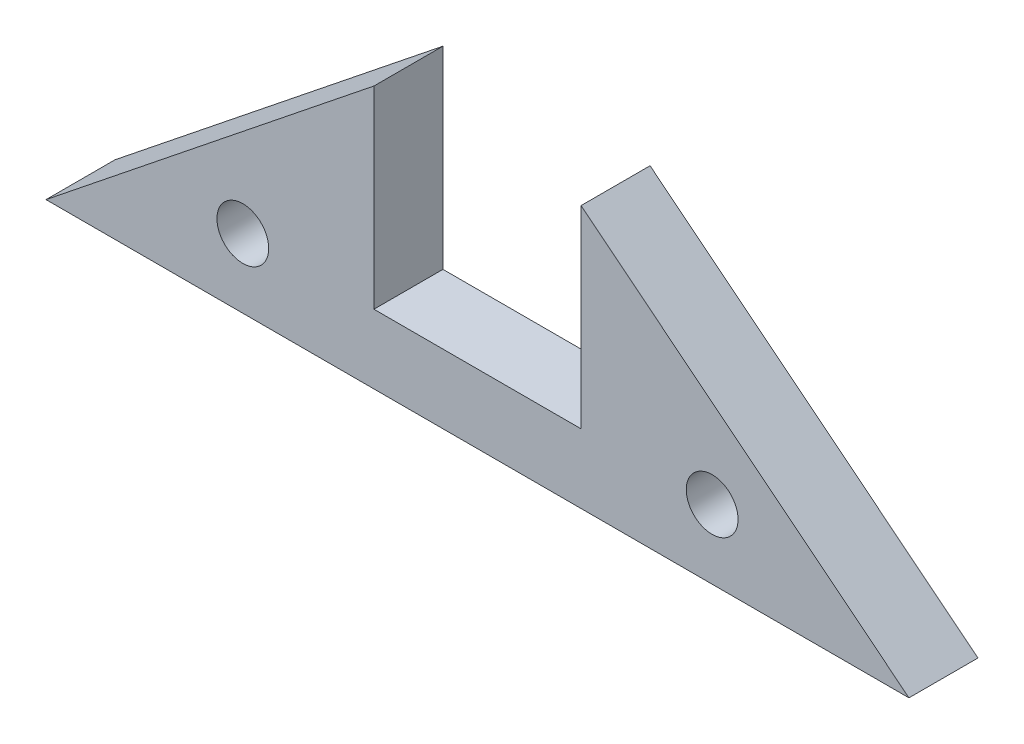
ISO-10303-21;
HEADER;
FILE_DESCRIPTION(('STEP AP214'),'2;1');
FILE_NAME('part.step','',(''),(''),'','','');
FILE_SCHEMA(('AUTOMOTIVE_DESIGN { 1 0 10303 214 1 1 1 1 }'));
ENDSEC;
DATA;
#1=APPLICATION_CONTEXT('core data for automotive mechanical design processes');
#2=APPLICATION_PROTOCOL_DEFINITION('international standard','automotive_design',2000,#1);
#3=PRODUCT_CONTEXT('',#1,'mechanical');
#4=PRODUCT('Part','Part','',(#3));
#5=PRODUCT_RELATED_PRODUCT_CATEGORY('part','',(#4));
#6=PRODUCT_DEFINITION_FORMATION('','',#4);
#7=PRODUCT_DEFINITION_CONTEXT('part definition',#1,'design');
#8=PRODUCT_DEFINITION('design','',#6,#7);
#9=PRODUCT_DEFINITION_SHAPE('','',#8);
#10=(LENGTH_UNIT() NAMED_UNIT(*) SI_UNIT(.MILLI.,.METRE.));
#11=(NAMED_UNIT(*) PLANE_ANGLE_UNIT() SI_UNIT($,.RADIAN.));
#12=(NAMED_UNIT(*) SI_UNIT($,.STERADIAN.) SOLID_ANGLE_UNIT());
#13=UNCERTAINTY_MEASURE_WITH_UNIT(LENGTH_MEASURE(1.E-05),#10,'distance_accuracy_value','');
#14=(GEOMETRIC_REPRESENTATION_CONTEXT(3) GLOBAL_UNCERTAINTY_ASSIGNED_CONTEXT((#13)) GLOBAL_UNIT_ASSIGNED_CONTEXT((#10,
#11,#12)) REPRESENTATION_CONTEXT('',''));
#15=CARTESIAN_POINT('',(0.,0.,0.));
#16=DIRECTION('',(0.,0.,1.));
#17=DIRECTION('',(1.,0.,0.));
#18=AXIS2_PLACEMENT_3D('',#15,#16,#17);
#19=CARTESIAN_POINT('',(31.75,25.4,5.08));
#20=DIRECTION('',(0.624695047554424,-0.78086880944303,0.));
#21=DIRECTION('',(0.78086880944303,0.624695047554424,0.));
#22=AXIS2_PLACEMENT_3D('',#19,#20,#21);
#23=PLANE('',#22);
#24=DIRECTION('',(-0.78086880944303,-0.624695047554424,0.));
#25=VECTOR('',#24,1.);
#26=CARTESIAN_POINT('',(31.75,25.4,5.08));
#27=LINE('',#26,#25);
#28=CARTESIAN_POINT('',(24.13,19.304,5.08));
#29=VERTEX_POINT('',#28);
#30=CARTESIAN_POINT('',(0.,0.,5.08));
#31=VERTEX_POINT('',#30);
#32=EDGE_CURVE('E99',#29,#31,#27,.T.);
#33=ORIENTED_EDGE('',*,*,#32,.F.);
#34=DIRECTION('',(0.,0.,-1.));
#35=VECTOR('',#34,1.);
#36=CARTESIAN_POINT('',(24.13,19.304,5.08));
#37=LINE('',#36,#35);
#38=CARTESIAN_POINT('',(24.13,19.304,0.));
#39=VERTEX_POINT('',#38);
#40=EDGE_CURVE('E129',#29,#39,#37,.T.);
#41=ORIENTED_EDGE('',*,*,#40,.T.);
#42=DIRECTION('',(-0.78086880944303,-0.624695047554424,0.));
#43=VECTOR('',#42,1.);
#44=CARTESIAN_POINT('',(31.75,25.4,0.));
#45=LINE('',#44,#43);
#46=CARTESIAN_POINT('',(0.,0.,0.));
#47=VERTEX_POINT('',#46);
#48=EDGE_CURVE('E85',#39,#47,#45,.T.);
#49=ORIENTED_EDGE('',*,*,#48,.T.);
#50=DIRECTION('',(0.,0.,-1.));
#51=VECTOR('',#50,1.);
#52=CARTESIAN_POINT('',(0.,0.,5.08));
#53=LINE('',#52,#51);
#54=EDGE_CURVE('E80',#31,#47,#53,.T.);
#55=ORIENTED_EDGE('',*,*,#54,.F.);
#56=EDGE_LOOP('',(#33,#41,#49,#55));
#57=FACE_BOUND('',#56,.T.);
#58=ADVANCED_FACE('F38',(#57),#23,.F.);
#59=CARTESIAN_POINT('',(0.,0.,5.08));
#60=DIRECTION('',(0.,1.,0.));
#61=DIRECTION('',(0.,0.,1.));
#62=AXIS2_PLACEMENT_3D('',#59,#60,#61);
#63=PLANE('',#62);
#64=DIRECTION('',(1.,0.,0.));
#65=VECTOR('',#64,1.);
#66=CARTESIAN_POINT('',(0.,0.,0.));
#67=LINE('',#66,#65);
#68=CARTESIAN_POINT('',(63.5,0.,0.));
#69=VERTEX_POINT('',#68);
#70=EDGE_CURVE('E74',#47,#69,#67,.T.);
#71=ORIENTED_EDGE('',*,*,#70,.T.);
#72=DIRECTION('',(0.,0.,-1.));
#73=VECTOR('',#72,1.);
#74=CARTESIAN_POINT('',(63.5,0.,5.08));
#75=LINE('',#74,#73);
#76=CARTESIAN_POINT('',(63.5,0.,5.08));
#77=VERTEX_POINT('',#76);
#78=EDGE_CURVE('E77',#77,#69,#75,.T.);
#79=ORIENTED_EDGE('',*,*,#78,.F.);
#80=DIRECTION('',(1.,0.,0.));
#81=VECTOR('',#80,1.);
#82=CARTESIAN_POINT('',(0.,0.,5.08));
#83=LINE('',#82,#81);
#84=EDGE_CURVE('E61',#31,#77,#83,.T.);
#85=ORIENTED_EDGE('',*,*,#84,.F.);
#86=ORIENTED_EDGE('',*,*,#54,.T.);
#87=EDGE_LOOP('',(#71,#79,#85,#86));
#88=FACE_BOUND('',#87,.T.);
#89=ADVANCED_FACE('F76',(#88),#63,.F.);
#90=CARTESIAN_POINT('',(63.5,0.,5.08));
#91=DIRECTION('',(-0.624695047554424,-0.78086880944303,0.));
#92=DIRECTION('',(0.78086880944303,-0.624695047554424,0.));
#93=AXIS2_PLACEMENT_3D('',#90,#91,#92);
#94=PLANE('',#93);
#95=DIRECTION('',(-0.78086880944303,0.624695047554424,0.));
#96=VECTOR('',#95,1.);
#97=CARTESIAN_POINT('',(63.5,0.,0.));
#98=LINE('',#97,#96);
#99=CARTESIAN_POINT('',(39.37,19.304,0.));
#100=VERTEX_POINT('',#99);
#101=EDGE_CURVE('E84',#69,#100,#98,.T.);
#102=ORIENTED_EDGE('',*,*,#101,.T.);
#103=DIRECTION('',(0.,0.,1.));
#104=VECTOR('',#103,1.);
#105=CARTESIAN_POINT('',(39.37,19.304,5.08));
#106=LINE('',#105,#104);
#107=CARTESIAN_POINT('',(39.37,19.304,5.08));
#108=VERTEX_POINT('',#107);
#109=EDGE_CURVE('E109',#100,#108,#106,.T.);
#110=ORIENTED_EDGE('',*,*,#109,.T.);
#111=DIRECTION('',(-0.78086880944303,0.624695047554424,0.));
#112=VECTOR('',#111,1.);
#113=CARTESIAN_POINT('',(63.5,0.,5.08));
#114=LINE('',#113,#112);
#115=EDGE_CURVE('E92',#77,#108,#114,.T.);
#116=ORIENTED_EDGE('',*,*,#115,.F.);
#117=ORIENTED_EDGE('',*,*,#78,.T.);
#118=EDGE_LOOP('',(#102,#110,#116,#117));
#119=FACE_BOUND('',#118,.T.);
#120=ADVANCED_FACE('F89',(#119),#94,.F.);
#121=CARTESIAN_POINT('',(0.,0.,5.08));
#122=DIRECTION('',(0.,0.,-1.));
#123=DIRECTION('',(-1.,0.,0.));
#124=AXIS2_PLACEMENT_3D('',#121,#122,#123);
#125=PLANE('',#124);
#126=CARTESIAN_POINT('',(14.4819677815397,5.08,5.08));
#127=DIRECTION('',(0.,0.,1.));
#128=DIRECTION('',(1.,0.,0.));
#129=AXIS2_PLACEMENT_3D('',#126,#127,#128);
#130=CIRCLE('',#129,1.905);
#131=CARTESIAN_POINT('',(16.3869677815397,5.08,5.08));
#132=VERTEX_POINT('',#131);
#133=EDGE_CURVE('E136',#132,#132,#130,.T.);
#134=ORIENTED_EDGE('',*,*,#133,.F.);
#135=EDGE_LOOP('',(#134));
#136=FACE_BOUND('',#135,.T.);
#137=CARTESIAN_POINT('',(49.0180322184603,5.08,5.08));
#138=DIRECTION('',(0.,0.,1.));
#139=DIRECTION('',(1.,0.,0.));
#140=AXIS2_PLACEMENT_3D('',#137,#138,#139);
#141=CIRCLE('',#140,1.905);
#142=CARTESIAN_POINT('',(50.9230322184603,5.08,5.08));
#143=VERTEX_POINT('',#142);
#144=EDGE_CURVE('E132',#143,#143,#141,.T.);
#145=ORIENTED_EDGE('',*,*,#144,.F.);
#146=EDGE_LOOP('',(#145));
#147=FACE_BOUND('',#146,.T.);
#148=DIRECTION('',(-1.,0.,0.));
#149=VECTOR('',#148,1.);
#150=CARTESIAN_POINT('',(24.13,5.08,5.08));
#151=LINE('',#150,#149);
#152=CARTESIAN_POINT('',(39.37,5.08,5.08));
#153=VERTEX_POINT('',#152);
#154=CARTESIAN_POINT('',(24.13,5.08,5.08));
#155=VERTEX_POINT('',#154);
#156=EDGE_CURVE('E116',#153,#155,#151,.T.);
#157=ORIENTED_EDGE('',*,*,#156,.T.);
#158=DIRECTION('',(0.,-1.,0.));
#159=VECTOR('',#158,1.);
#160=CARTESIAN_POINT('',(24.13,25.4,5.08));
#161=LINE('',#160,#159);
#162=EDGE_CURVE('E123',#29,#155,#161,.T.);
#163=ORIENTED_EDGE('',*,*,#162,.F.);
#164=ORIENTED_EDGE('',*,*,#32,.T.);
#165=ORIENTED_EDGE('',*,*,#84,.T.);
#166=ORIENTED_EDGE('',*,*,#115,.T.);
#167=DIRECTION('',(0.,-1.,0.));
#168=VECTOR('',#167,1.);
#169=CARTESIAN_POINT('',(39.37,25.4,5.08));
#170=LINE('',#169,#168);
#171=EDGE_CURVE('E122',#108,#153,#170,.T.);
#172=ORIENTED_EDGE('',*,*,#171,.T.);
#173=EDGE_LOOP('',(#157,#163,#164,#165,#166,#172));
#174=FACE_BOUND('',#173,.T.);
#175=ADVANCED_FACE('F161',(#136,#147,#174),#125,.F.);
#176=CARTESIAN_POINT('',(0.,0.,0.));
#177=DIRECTION('',(0.,0.,-1.));
#178=DIRECTION('',(-1.,0.,0.));
#179=AXIS2_PLACEMENT_3D('',#176,#177,#178);
#180=PLANE('',#179);
#181=DIRECTION('',(0.,1.,0.));
#182=VECTOR('',#181,1.);
#183=CARTESIAN_POINT('',(24.13,0.,0.));
#184=LINE('',#183,#182);
#185=CARTESIAN_POINT('',(24.13,5.08,0.));
#186=VERTEX_POINT('',#185);
#187=EDGE_CURVE('E11',#186,#39,#184,.T.);
#188=ORIENTED_EDGE('',*,*,#187,.F.);
#189=DIRECTION('',(1.,0.,0.));
#190=VECTOR('',#189,1.);
#191=CARTESIAN_POINT('',(24.13,5.08,0.));
#192=LINE('',#191,#190);
#193=CARTESIAN_POINT('',(39.37,5.08,0.));
#194=VERTEX_POINT('',#193);
#195=EDGE_CURVE('E110',#186,#194,#192,.T.);
#196=ORIENTED_EDGE('',*,*,#195,.T.);
#197=DIRECTION('',(0.,-1.,0.));
#198=VECTOR('',#197,1.);
#199=CARTESIAN_POINT('',(39.37,0.,0.));
#200=LINE('',#199,#198);
#201=EDGE_CURVE('E45',#100,#194,#200,.T.);
#202=ORIENTED_EDGE('',*,*,#201,.F.);
#203=ORIENTED_EDGE('',*,*,#101,.F.);
#204=ORIENTED_EDGE('',*,*,#70,.F.);
#205=ORIENTED_EDGE('',*,*,#48,.F.);
#206=EDGE_LOOP('',(#188,#196,#202,#203,#204,#205));
#207=FACE_BOUND('',#206,.T.);
#208=CARTESIAN_POINT('',(14.4819677815397,5.08,0.));
#209=DIRECTION('',(0.,0.,1.));
#210=DIRECTION('',(1.,0.,0.));
#211=AXIS2_PLACEMENT_3D('',#208,#209,#210);
#212=CIRCLE('',#211,1.905);
#213=CARTESIAN_POINT('',(16.3869677815397,5.08,0.));
#214=VERTEX_POINT('',#213);
#215=EDGE_CURVE('E133',#214,#214,#212,.T.);
#216=ORIENTED_EDGE('',*,*,#215,.T.);
#217=EDGE_LOOP('',(#216));
#218=FACE_BOUND('',#217,.T.);
#219=CARTESIAN_POINT('',(49.0180322184603,5.08,0.));
#220=DIRECTION('',(0.,0.,1.));
#221=DIRECTION('',(1.,0.,0.));
#222=AXIS2_PLACEMENT_3D('',#219,#220,#221);
#223=CIRCLE('',#222,1.905);
#224=CARTESIAN_POINT('',(50.9230322184603,5.08,0.));
#225=VERTEX_POINT('',#224);
#226=EDGE_CURVE('E139',#225,#225,#223,.T.);
#227=ORIENTED_EDGE('',*,*,#226,.T.);
#228=EDGE_LOOP('',(#227));
#229=FACE_BOUND('',#228,.T.);
#230=ADVANCED_FACE('F96',(#207,#218,#229),#180,.T.);
#231=CARTESIAN_POINT('',(49.0180322184603,5.08,0.));
#232=DIRECTION('',(0.,0.,1.));
#233=DIRECTION('',(1.,0.,0.));
#234=AXIS2_PLACEMENT_3D('',#231,#232,#233);
#235=CYLINDRICAL_SURFACE('',#234,1.905);
#236=ORIENTED_EDGE('',*,*,#226,.F.);
#237=EDGE_LOOP('',(#236));
#238=FACE_BOUND('',#237,.T.);
#239=ORIENTED_EDGE('',*,*,#144,.T.);
#240=EDGE_LOOP('',(#239));
#241=FACE_BOUND('',#240,.T.);
#242=ADVANCED_FACE('F169',(#238,#241),#235,.F.);
#243=CARTESIAN_POINT('',(14.4819677815397,5.08,0.));
#244=DIRECTION('',(0.,0.,1.));
#245=DIRECTION('',(1.,0.,0.));
#246=AXIS2_PLACEMENT_3D('',#243,#244,#245);
#247=CYLINDRICAL_SURFACE('',#246,1.905);
#248=ORIENTED_EDGE('',*,*,#215,.F.);
#249=EDGE_LOOP('',(#248));
#250=FACE_BOUND('',#249,.T.);
#251=ORIENTED_EDGE('',*,*,#133,.T.);
#252=EDGE_LOOP('',(#251));
#253=FACE_BOUND('',#252,.T.);
#254=ADVANCED_FACE('F208',(#250,#253),#247,.F.);
#255=CARTESIAN_POINT('',(24.13,25.4,0.));
#256=DIRECTION('',(-1.,0.,0.));
#257=DIRECTION('',(0.,0.,1.));
#258=AXIS2_PLACEMENT_3D('',#255,#256,#257);
#259=PLANE('',#258);
#260=ORIENTED_EDGE('',*,*,#162,.T.);
#261=DIRECTION('',(0.,0.,-1.));
#262=VECTOR('',#261,1.);
#263=CARTESIAN_POINT('',(24.13,5.08,0.));
#264=LINE('',#263,#262);
#265=EDGE_CURVE('E114',#155,#186,#264,.T.);
#266=ORIENTED_EDGE('',*,*,#265,.T.);
#267=ORIENTED_EDGE('',*,*,#187,.T.);
#268=ORIENTED_EDGE('',*,*,#40,.F.);
#269=EDGE_LOOP('',(#260,#266,#267,#268));
#270=FACE_BOUND('',#269,.T.);
#271=ADVANCED_FACE('F159',(#270),#259,.F.);
#272=CARTESIAN_POINT('',(39.37,25.4,0.));
#273=DIRECTION('',(1.,0.,0.));
#274=DIRECTION('',(0.,0.,-1.));
#275=AXIS2_PLACEMENT_3D('',#272,#273,#274);
#276=PLANE('',#275);
#277=ORIENTED_EDGE('',*,*,#201,.T.);
#278=DIRECTION('',(0.,0.,1.));
#279=VECTOR('',#278,1.);
#280=CARTESIAN_POINT('',(39.37,5.08,0.));
#281=LINE('',#280,#279);
#282=EDGE_CURVE('E52',#194,#153,#281,.T.);
#283=ORIENTED_EDGE('',*,*,#282,.T.);
#284=ORIENTED_EDGE('',*,*,#171,.F.);
#285=ORIENTED_EDGE('',*,*,#109,.F.);
#286=EDGE_LOOP('',(#277,#283,#284,#285));
#287=FACE_BOUND('',#286,.T.);
#288=ADVANCED_FACE('F106',(#287),#276,.F.);
#289=CARTESIAN_POINT('',(0.,5.08,0.));
#290=DIRECTION('',(0.,1.,0.));
#291=DIRECTION('',(0.,0.,1.));
#292=AXIS2_PLACEMENT_3D('',#289,#290,#291);
#293=PLANE('',#292);
#294=ORIENTED_EDGE('',*,*,#265,.F.);
#295=ORIENTED_EDGE('',*,*,#156,.F.);
#296=ORIENTED_EDGE('',*,*,#282,.F.);
#297=ORIENTED_EDGE('',*,*,#195,.F.);
#298=EDGE_LOOP('',(#294,#295,#296,#297));
#299=FACE_BOUND('',#298,.T.);
#300=ADVANCED_FACE('F160',(#299),#293,.T.);
#301=CLOSED_SHELL('',(#58,#89,#120,#175,#230,#242,#254,#271,#288,#300));
#302=MANIFOLD_SOLID_BREP('B2',#301);
#303=ADVANCED_BREP_SHAPE_REPRESENTATION('',(#18,#302),#14);
#304=SHAPE_DEFINITION_REPRESENTATION(#9,#303);
ENDSEC;
END-ISO-10303-21;
